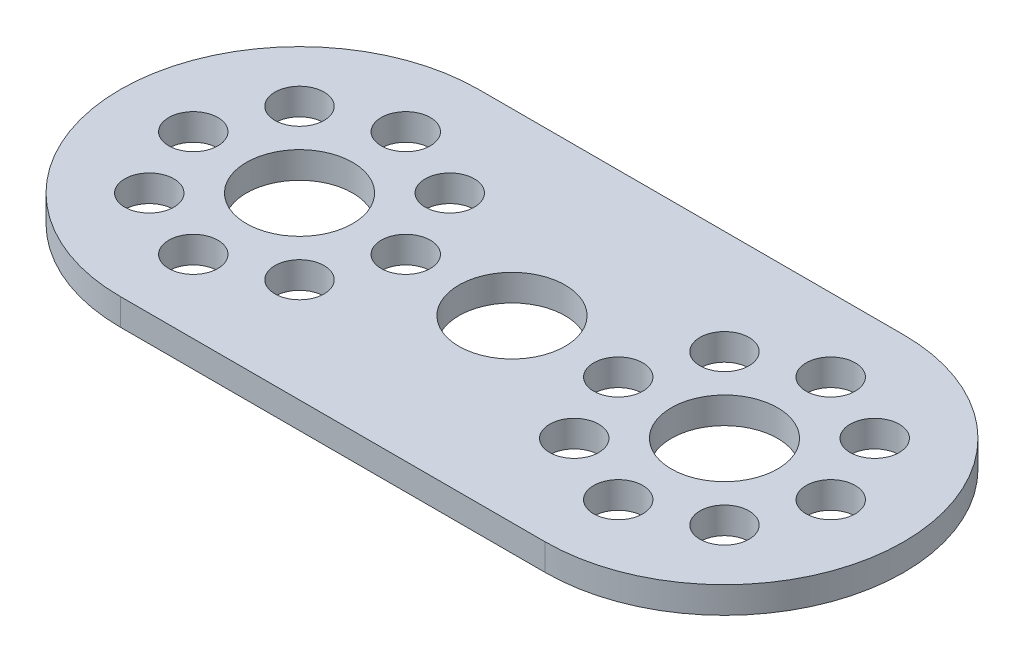
ISO-10303-21;
HEADER;
FILE_DESCRIPTION(('STEP AP214'),'2;1');
FILE_NAME('part.step','',(''),(''),'','','');
FILE_SCHEMA(('AUTOMOTIVE_DESIGN { 1 0 10303 214 1 1 1 1 }'));
ENDSEC;
DATA;
#1=APPLICATION_CONTEXT('core data for automotive mechanical design processes');
#2=APPLICATION_PROTOCOL_DEFINITION('international standard','automotive_design',2000,#1);
#3=PRODUCT_CONTEXT('',#1,'mechanical');
#4=PRODUCT('Part','Part','',(#3));
#5=PRODUCT_RELATED_PRODUCT_CATEGORY('part','',(#4));
#6=PRODUCT_DEFINITION_FORMATION('','',#4);
#7=PRODUCT_DEFINITION_CONTEXT('part definition',#1,'design');
#8=PRODUCT_DEFINITION('design','',#6,#7);
#9=PRODUCT_DEFINITION_SHAPE('','',#8);
#10=(LENGTH_UNIT() NAMED_UNIT(*) SI_UNIT(.MILLI.,.METRE.));
#11=(NAMED_UNIT(*) PLANE_ANGLE_UNIT() SI_UNIT($,.RADIAN.));
#12=(NAMED_UNIT(*) SI_UNIT($,.STERADIAN.) SOLID_ANGLE_UNIT());
#13=UNCERTAINTY_MEASURE_WITH_UNIT(LENGTH_MEASURE(1.E-05),#10,'distance_accuracy_value','');
#14=(GEOMETRIC_REPRESENTATION_CONTEXT(3) GLOBAL_UNCERTAINTY_ASSIGNED_CONTEXT((#13)) GLOBAL_UNIT_ASSIGNED_CONTEXT((#10,
#11,#12)) REPRESENTATION_CONTEXT('',''));
#15=CARTESIAN_POINT('',(0.,0.,0.));
#16=DIRECTION('',(0.,0.,1.));
#17=DIRECTION('',(1.,0.,0.));
#18=AXIS2_PLACEMENT_3D('',#15,#16,#17);
#19=CARTESIAN_POINT('',(-16.,2.,0.));
#20=DIRECTION('',(0.,1.,0.));
#21=DIRECTION('',(0.,0.,1.));
#22=AXIS2_PLACEMENT_3D('',#19,#20,#21);
#23=PLANE('',#22);
#24=CARTESIAN_POINT('',(-8.,2.,0.));
#25=DIRECTION('',(0.,1.,0.));
#26=DIRECTION('',(0.,0.,-1.));
#27=AXIS2_PLACEMENT_3D('',#24,#25,#26);
#28=CIRCLE('',#27,1.85);
#29=CARTESIAN_POINT('',(-8.,2.,-1.85));
#30=VERTEX_POINT('',#29);
#31=EDGE_CURVE('E214',#30,#30,#28,.T.);
#32=ORIENTED_EDGE('',*,*,#31,.F.);
#33=EDGE_LOOP('',(#32));
#34=FACE_BOUND('',#33,.T.);
#35=CARTESIAN_POINT('',(-16.,2.,-8.));
#36=DIRECTION('',(0.,1.,0.));
#37=DIRECTION('',(0.,0.,-1.));
#38=AXIS2_PLACEMENT_3D('',#35,#36,#37);
#39=CIRCLE('',#38,1.85);
#40=CARTESIAN_POINT('',(-16.,2.,-9.85));
#41=VERTEX_POINT('',#40);
#42=EDGE_CURVE('E202',#41,#41,#39,.T.);
#43=ORIENTED_EDGE('',*,*,#42,.F.);
#44=EDGE_LOOP('',(#43));
#45=FACE_BOUND('',#44,.T.);
#46=CARTESIAN_POINT('',(-24.,2.,0.));
#47=DIRECTION('',(0.,1.,0.));
#48=DIRECTION('',(0.,0.,-1.));
#49=AXIS2_PLACEMENT_3D('',#46,#47,#48);
#50=CIRCLE('',#49,1.85);
#51=CARTESIAN_POINT('',(-24.,2.,-1.85000000000001));
#52=VERTEX_POINT('',#51);
#53=EDGE_CURVE('E190',#52,#52,#50,.T.);
#54=ORIENTED_EDGE('',*,*,#53,.F.);
#55=EDGE_LOOP('',(#54));
#56=FACE_BOUND('',#55,.T.);
#57=CARTESIAN_POINT('',(-16.,2.,8.));
#58=DIRECTION('',(0.,1.,0.));
#59=DIRECTION('',(0.,0.,-1.));
#60=AXIS2_PLACEMENT_3D('',#57,#58,#59);
#61=CIRCLE('',#60,1.85);
#62=CARTESIAN_POINT('',(-16.,2.,6.15));
#63=VERTEX_POINT('',#62);
#64=EDGE_CURVE('E178',#63,#63,#61,.T.);
#65=ORIENTED_EDGE('',*,*,#64,.F.);
#66=EDGE_LOOP('',(#65));
#67=FACE_BOUND('',#66,.T.);
#68=CARTESIAN_POINT('',(10.3431457505076,2.,5.65685424949238));
#69=DIRECTION('',(0.,1.,0.));
#70=DIRECTION('',(0.,0.,1.));
#71=AXIS2_PLACEMENT_3D('',#68,#69,#70);
#72=CIRCLE('',#71,1.85);
#73=CARTESIAN_POINT('',(10.3431457505076,2.,7.50685424949238));
#74=VERTEX_POINT('',#73);
#75=EDGE_CURVE('E166',#74,#74,#72,.T.);
#76=ORIENTED_EDGE('',*,*,#75,.F.);
#77=EDGE_LOOP('',(#76));
#78=FACE_BOUND('',#77,.T.);
#79=CARTESIAN_POINT('',(21.6568542494924,2.,5.65685424949237));
#80=DIRECTION('',(0.,1.,0.));
#81=DIRECTION('',(0.,0.,1.));
#82=AXIS2_PLACEMENT_3D('',#79,#80,#81);
#83=CIRCLE('',#82,1.85);
#84=CARTESIAN_POINT('',(21.6568542494924,2.,7.50685424949237));
#85=VERTEX_POINT('',#84);
#86=EDGE_CURVE('E154',#85,#85,#83,.T.);
#87=ORIENTED_EDGE('',*,*,#86,.F.);
#88=EDGE_LOOP('',(#87));
#89=FACE_BOUND('',#88,.T.);
#90=CARTESIAN_POINT('',(21.6568542494924,2.,-5.65685424949239));
#91=DIRECTION('',(0.,1.,0.));
#92=DIRECTION('',(0.,0.,1.));
#93=AXIS2_PLACEMENT_3D('',#90,#91,#92);
#94=CIRCLE('',#93,1.85);
#95=CARTESIAN_POINT('',(21.6568542494924,2.,-3.80685424949238));
#96=VERTEX_POINT('',#95);
#97=EDGE_CURVE('E142',#96,#96,#94,.T.);
#98=ORIENTED_EDGE('',*,*,#97,.F.);
#99=EDGE_LOOP('',(#98));
#100=FACE_BOUND('',#99,.T.);
#101=CARTESIAN_POINT('',(10.3431457505076,2.,-5.65685424949238));
#102=DIRECTION('',(0.,1.,0.));
#103=DIRECTION('',(0.,0.,1.));
#104=AXIS2_PLACEMENT_3D('',#101,#102,#103);
#105=CIRCLE('',#104,1.85);
#106=CARTESIAN_POINT('',(10.3431457505076,2.,-3.80685424949238));
#107=VERTEX_POINT('',#106);
#108=EDGE_CURVE('E130',#107,#107,#105,.T.);
#109=ORIENTED_EDGE('',*,*,#108,.F.);
#110=EDGE_LOOP('',(#109));
#111=FACE_BOUND('',#110,.T.);
#112=CARTESIAN_POINT('',(16.,2.,0.));
#113=DIRECTION('',(0.,1.,0.));
#114=DIRECTION('',(0.,0.,1.));
#115=AXIS2_PLACEMENT_3D('',#112,#113,#114);
#116=CIRCLE('',#115,4.);
#117=CARTESIAN_POINT('',(16.,2.,4.));
#118=VERTEX_POINT('',#117);
#119=EDGE_CURVE('E118',#118,#118,#116,.T.);
#120=ORIENTED_EDGE('',*,*,#119,.F.);
#121=EDGE_LOOP('',(#120));
#122=FACE_BOUND('',#121,.T.);
#123=CARTESIAN_POINT('',(-16.,2.,0.));
#124=DIRECTION('',(0.,1.,0.));
#125=DIRECTION('',(0.,0.,1.));
#126=AXIS2_PLACEMENT_3D('',#123,#124,#125);
#127=CIRCLE('',#126,13.5);
#128=CARTESIAN_POINT('',(-16.,2.,-13.5));
#129=VERTEX_POINT('',#128);
#130=CARTESIAN_POINT('',(-16.,2.,13.5));
#131=VERTEX_POINT('',#130);
#132=EDGE_CURVE('E88',#129,#131,#127,.T.);
#133=ORIENTED_EDGE('',*,*,#132,.T.);
#134=DIRECTION('',(1.,0.,0.));
#135=VECTOR('',#134,1.);
#136=CARTESIAN_POINT('',(-16.,2.,13.5));
#137=LINE('',#136,#135);
#138=CARTESIAN_POINT('',(16.,2.,13.5));
#139=VERTEX_POINT('',#138);
#140=EDGE_CURVE('E83',#131,#139,#137,.T.);
#141=ORIENTED_EDGE('',*,*,#140,.T.);
#142=CARTESIAN_POINT('',(16.,2.,0.));
#143=DIRECTION('',(0.,1.,0.));
#144=DIRECTION('',(0.,0.,-1.));
#145=AXIS2_PLACEMENT_3D('',#142,#143,#144);
#146=CIRCLE('',#145,13.5);
#147=CARTESIAN_POINT('',(16.,2.,-13.5));
#148=VERTEX_POINT('',#147);
#149=EDGE_CURVE('E86',#139,#148,#146,.T.);
#150=ORIENTED_EDGE('',*,*,#149,.T.);
#151=DIRECTION('',(-1.,0.,0.));
#152=VECTOR('',#151,1.);
#153=CARTESIAN_POINT('',(-16.,2.,-13.5));
#154=LINE('',#153,#152);
#155=EDGE_CURVE('E53',#148,#129,#154,.T.);
#156=ORIENTED_EDGE('',*,*,#155,.T.);
#157=EDGE_LOOP('',(#133,#141,#150,#156));
#158=FACE_BOUND('',#157,.T.);
#159=CARTESIAN_POINT('',(0.,2.,0.));
#160=DIRECTION('',(0.,1.,0.));
#161=DIRECTION('',(0.,0.,1.));
#162=AXIS2_PLACEMENT_3D('',#159,#160,#161);
#163=CIRCLE('',#162,4.);
#164=CARTESIAN_POINT('',(0.,2.,4.));
#165=VERTEX_POINT('',#164);
#166=EDGE_CURVE('E103',#165,#165,#163,.T.);
#167=ORIENTED_EDGE('',*,*,#166,.F.);
#168=EDGE_LOOP('',(#167));
#169=FACE_BOUND('',#168,.T.);
#170=CARTESIAN_POINT('',(8.,2.,0.));
#171=DIRECTION('',(0.,1.,0.));
#172=DIRECTION('',(0.,0.,1.));
#173=AXIS2_PLACEMENT_3D('',#170,#171,#172);
#174=CIRCLE('',#173,1.85);
#175=CARTESIAN_POINT('',(8.,2.,1.85));
#176=VERTEX_POINT('',#175);
#177=EDGE_CURVE('E124',#176,#176,#174,.T.);
#178=ORIENTED_EDGE('',*,*,#177,.F.);
#179=EDGE_LOOP('',(#178));
#180=FACE_BOUND('',#179,.T.);
#181=CARTESIAN_POINT('',(16.,2.,-8.));
#182=DIRECTION('',(0.,1.,0.));
#183=DIRECTION('',(0.,0.,1.));
#184=AXIS2_PLACEMENT_3D('',#181,#182,#183);
#185=CIRCLE('',#184,1.85);
#186=CARTESIAN_POINT('',(16.,2.,-6.15));
#187=VERTEX_POINT('',#186);
#188=EDGE_CURVE('E136',#187,#187,#185,.T.);
#189=ORIENTED_EDGE('',*,*,#188,.F.);
#190=EDGE_LOOP('',(#189));
#191=FACE_BOUND('',#190,.T.);
#192=CARTESIAN_POINT('',(24.,2.,0.));
#193=DIRECTION('',(0.,1.,0.));
#194=DIRECTION('',(0.,0.,1.));
#195=AXIS2_PLACEMENT_3D('',#192,#193,#194);
#196=CIRCLE('',#195,1.85);
#197=CARTESIAN_POINT('',(24.,2.,1.85));
#198=VERTEX_POINT('',#197);
#199=EDGE_CURVE('E148',#198,#198,#196,.T.);
#200=ORIENTED_EDGE('',*,*,#199,.F.);
#201=EDGE_LOOP('',(#200));
#202=FACE_BOUND('',#201,.T.);
#203=CARTESIAN_POINT('',(16.,2.,8.));
#204=DIRECTION('',(0.,1.,0.));
#205=DIRECTION('',(0.,0.,1.));
#206=AXIS2_PLACEMENT_3D('',#203,#204,#205);
#207=CIRCLE('',#206,1.85);
#208=CARTESIAN_POINT('',(16.,2.,9.84999999999999));
#209=VERTEX_POINT('',#208);
#210=EDGE_CURVE('E160',#209,#209,#207,.T.);
#211=ORIENTED_EDGE('',*,*,#210,.F.);
#212=EDGE_LOOP('',(#211));
#213=FACE_BOUND('',#212,.T.);
#214=CARTESIAN_POINT('',(-10.3431457505076,2.,5.65685424949238));
#215=DIRECTION('',(0.,1.,0.));
#216=DIRECTION('',(0.,0.,-1.));
#217=AXIS2_PLACEMENT_3D('',#214,#215,#216);
#218=CIRCLE('',#217,1.85);
#219=CARTESIAN_POINT('',(-10.3431457505076,2.,3.80685424949238));
#220=VERTEX_POINT('',#219);
#221=EDGE_CURVE('E172',#220,#220,#218,.T.);
#222=ORIENTED_EDGE('',*,*,#221,.F.);
#223=EDGE_LOOP('',(#222));
#224=FACE_BOUND('',#223,.T.);
#225=CARTESIAN_POINT('',(-21.6568542494924,2.,5.65685424949237));
#226=DIRECTION('',(0.,1.,0.));
#227=DIRECTION('',(0.,0.,-1.));
#228=AXIS2_PLACEMENT_3D('',#225,#226,#227);
#229=CIRCLE('',#228,1.85);
#230=CARTESIAN_POINT('',(-21.6568542494924,2.,3.80685424949238));
#231=VERTEX_POINT('',#230);
#232=EDGE_CURVE('E184',#231,#231,#229,.T.);
#233=ORIENTED_EDGE('',*,*,#232,.F.);
#234=EDGE_LOOP('',(#233));
#235=FACE_BOUND('',#234,.T.);
#236=CARTESIAN_POINT('',(-21.6568542494924,2.,-5.65685424949239));
#237=DIRECTION('',(0.,1.,0.));
#238=DIRECTION('',(0.,0.,-1.));
#239=AXIS2_PLACEMENT_3D('',#236,#237,#238);
#240=CIRCLE('',#239,1.85);
#241=CARTESIAN_POINT('',(-21.6568542494924,2.,-7.50685424949239));
#242=VERTEX_POINT('',#241);
#243=EDGE_CURVE('E196',#242,#242,#240,.T.);
#244=ORIENTED_EDGE('',*,*,#243,.F.);
#245=EDGE_LOOP('',(#244));
#246=FACE_BOUND('',#245,.T.);
#247=CARTESIAN_POINT('',(-10.3431457505076,2.,-5.65685424949238));
#248=DIRECTION('',(0.,1.,0.));
#249=DIRECTION('',(0.,0.,-1.));
#250=AXIS2_PLACEMENT_3D('',#247,#248,#249);
#251=CIRCLE('',#250,1.85);
#252=CARTESIAN_POINT('',(-10.3431457505076,2.,-7.50685424949238));
#253=VERTEX_POINT('',#252);
#254=EDGE_CURVE('E208',#253,#253,#251,.T.);
#255=ORIENTED_EDGE('',*,*,#254,.F.);
#256=EDGE_LOOP('',(#255));
#257=FACE_BOUND('',#256,.T.);
#258=CARTESIAN_POINT('',(-16.,2.,0.));
#259=DIRECTION('',(0.,1.,0.));
#260=DIRECTION('',(0.,0.,-1.));
#261=AXIS2_PLACEMENT_3D('',#258,#259,#260);
#262=CIRCLE('',#261,4.);
#263=CARTESIAN_POINT('',(-16.,2.,-4.));
#264=VERTEX_POINT('',#263);
#265=EDGE_CURVE('E220',#264,#264,#262,.T.);
#266=ORIENTED_EDGE('',*,*,#265,.F.);
#267=EDGE_LOOP('',(#266));
#268=FACE_BOUND('',#267,.T.);
#269=ADVANCED_FACE('F36',(#34,#45,#56,#67,#78,#89,#100,#111,#122,#158,#169,#180,#191,#202,#213,
#224,#235,#246,#257,#268),#23,.T.);
#270=CARTESIAN_POINT('',(-16.,0.,0.));
#271=DIRECTION('',(0.,1.,0.));
#272=DIRECTION('',(0.,0.,1.));
#273=AXIS2_PLACEMENT_3D('',#270,#271,#272);
#274=PLANE('',#273);
#275=CARTESIAN_POINT('',(-16.,0.,0.));
#276=DIRECTION('',(0.,1.,0.));
#277=DIRECTION('',(0.,0.,1.));
#278=AXIS2_PLACEMENT_3D('',#275,#276,#277);
#279=CIRCLE('',#278,13.5);
#280=CARTESIAN_POINT('',(-16.,0.,-13.5));
#281=VERTEX_POINT('',#280);
#282=CARTESIAN_POINT('',(-16.,0.,13.5));
#283=VERTEX_POINT('',#282);
#284=EDGE_CURVE('E100',#281,#283,#279,.T.);
#285=ORIENTED_EDGE('',*,*,#284,.F.);
#286=DIRECTION('',(-1.,0.,0.));
#287=VECTOR('',#286,1.);
#288=CARTESIAN_POINT('',(-16.,0.,-13.5));
#289=LINE('',#288,#287);
#290=CARTESIAN_POINT('',(16.,0.,-13.5));
#291=VERTEX_POINT('',#290);
#292=EDGE_CURVE('E76',#291,#281,#289,.T.);
#293=ORIENTED_EDGE('',*,*,#292,.F.);
#294=CARTESIAN_POINT('',(16.,0.,0.));
#295=DIRECTION('',(0.,1.,0.));
#296=DIRECTION('',(0.,0.,-1.));
#297=AXIS2_PLACEMENT_3D('',#294,#295,#296);
#298=CIRCLE('',#297,13.5);
#299=CARTESIAN_POINT('',(16.,0.,13.5));
#300=VERTEX_POINT('',#299);
#301=EDGE_CURVE('E70',#300,#291,#298,.T.);
#302=ORIENTED_EDGE('',*,*,#301,.F.);
#303=DIRECTION('',(1.,0.,0.));
#304=VECTOR('',#303,1.);
#305=CARTESIAN_POINT('',(-16.,0.,13.5));
#306=LINE('',#305,#304);
#307=EDGE_CURVE('E92',#283,#300,#306,.T.);
#308=ORIENTED_EDGE('',*,*,#307,.F.);
#309=EDGE_LOOP('',(#285,#293,#302,#308));
#310=FACE_BOUND('',#309,.T.);
#311=CARTESIAN_POINT('',(0.,0.,0.));
#312=DIRECTION('',(0.,1.,0.));
#313=DIRECTION('',(0.,0.,1.));
#314=AXIS2_PLACEMENT_3D('',#311,#312,#313);
#315=CIRCLE('',#314,4.);
#316=CARTESIAN_POINT('',(0.,0.,4.));
#317=VERTEX_POINT('',#316);
#318=EDGE_CURVE('E115',#317,#317,#315,.T.);
#319=ORIENTED_EDGE('',*,*,#318,.T.);
#320=EDGE_LOOP('',(#319));
#321=FACE_BOUND('',#320,.T.);
#322=CARTESIAN_POINT('',(16.,0.,0.));
#323=DIRECTION('',(0.,1.,0.));
#324=DIRECTION('',(0.,0.,1.));
#325=AXIS2_PLACEMENT_3D('',#322,#323,#324);
#326=CIRCLE('',#325,4.);
#327=CARTESIAN_POINT('',(16.,0.,4.));
#328=VERTEX_POINT('',#327);
#329=EDGE_CURVE('E121',#328,#328,#326,.T.);
#330=ORIENTED_EDGE('',*,*,#329,.T.);
#331=EDGE_LOOP('',(#330));
#332=FACE_BOUND('',#331,.T.);
#333=CARTESIAN_POINT('',(8.,0.,0.));
#334=DIRECTION('',(0.,1.,0.));
#335=DIRECTION('',(0.,0.,1.));
#336=AXIS2_PLACEMENT_3D('',#333,#334,#335);
#337=CIRCLE('',#336,1.85);
#338=CARTESIAN_POINT('',(8.,0.,1.85));
#339=VERTEX_POINT('',#338);
#340=EDGE_CURVE('E127',#339,#339,#337,.T.);
#341=ORIENTED_EDGE('',*,*,#340,.T.);
#342=EDGE_LOOP('',(#341));
#343=FACE_BOUND('',#342,.T.);
#344=CARTESIAN_POINT('',(10.3431457505076,0.,-5.65685424949238));
#345=DIRECTION('',(0.,1.,0.));
#346=DIRECTION('',(0.,0.,1.));
#347=AXIS2_PLACEMENT_3D('',#344,#345,#346);
#348=CIRCLE('',#347,1.85);
#349=CARTESIAN_POINT('',(10.3431457505076,0.,-3.80685424949238));
#350=VERTEX_POINT('',#349);
#351=EDGE_CURVE('E133',#350,#350,#348,.T.);
#352=ORIENTED_EDGE('',*,*,#351,.T.);
#353=EDGE_LOOP('',(#352));
#354=FACE_BOUND('',#353,.T.);
#355=CARTESIAN_POINT('',(16.,0.,-8.));
#356=DIRECTION('',(0.,1.,0.));
#357=DIRECTION('',(0.,0.,1.));
#358=AXIS2_PLACEMENT_3D('',#355,#356,#357);
#359=CIRCLE('',#358,1.85);
#360=CARTESIAN_POINT('',(16.,0.,-6.15));
#361=VERTEX_POINT('',#360);
#362=EDGE_CURVE('E139',#361,#361,#359,.T.);
#363=ORIENTED_EDGE('',*,*,#362,.T.);
#364=EDGE_LOOP('',(#363));
#365=FACE_BOUND('',#364,.T.);
#366=CARTESIAN_POINT('',(21.6568542494924,0.,-5.65685424949239));
#367=DIRECTION('',(0.,1.,0.));
#368=DIRECTION('',(0.,0.,1.));
#369=AXIS2_PLACEMENT_3D('',#366,#367,#368);
#370=CIRCLE('',#369,1.85);
#371=CARTESIAN_POINT('',(21.6568542494924,0.,-3.80685424949238));
#372=VERTEX_POINT('',#371);
#373=EDGE_CURVE('E145',#372,#372,#370,.T.);
#374=ORIENTED_EDGE('',*,*,#373,.T.);
#375=EDGE_LOOP('',(#374));
#376=FACE_BOUND('',#375,.T.);
#377=CARTESIAN_POINT('',(24.,0.,0.));
#378=DIRECTION('',(0.,1.,0.));
#379=DIRECTION('',(0.,0.,1.));
#380=AXIS2_PLACEMENT_3D('',#377,#378,#379);
#381=CIRCLE('',#380,1.85);
#382=CARTESIAN_POINT('',(24.,0.,1.85));
#383=VERTEX_POINT('',#382);
#384=EDGE_CURVE('E151',#383,#383,#381,.T.);
#385=ORIENTED_EDGE('',*,*,#384,.T.);
#386=EDGE_LOOP('',(#385));
#387=FACE_BOUND('',#386,.T.);
#388=CARTESIAN_POINT('',(21.6568542494924,0.,5.65685424949237));
#389=DIRECTION('',(0.,1.,0.));
#390=DIRECTION('',(0.,0.,1.));
#391=AXIS2_PLACEMENT_3D('',#388,#389,#390);
#392=CIRCLE('',#391,1.85);
#393=CARTESIAN_POINT('',(21.6568542494924,0.,7.50685424949237));
#394=VERTEX_POINT('',#393);
#395=EDGE_CURVE('E157',#394,#394,#392,.T.);
#396=ORIENTED_EDGE('',*,*,#395,.T.);
#397=EDGE_LOOP('',(#396));
#398=FACE_BOUND('',#397,.T.);
#399=CARTESIAN_POINT('',(16.,0.,8.));
#400=DIRECTION('',(0.,1.,0.));
#401=DIRECTION('',(0.,0.,1.));
#402=AXIS2_PLACEMENT_3D('',#399,#400,#401);
#403=CIRCLE('',#402,1.85);
#404=CARTESIAN_POINT('',(16.,0.,9.84999999999999));
#405=VERTEX_POINT('',#404);
#406=EDGE_CURVE('E163',#405,#405,#403,.T.);
#407=ORIENTED_EDGE('',*,*,#406,.T.);
#408=EDGE_LOOP('',(#407));
#409=FACE_BOUND('',#408,.T.);
#410=CARTESIAN_POINT('',(10.3431457505076,0.,5.65685424949238));
#411=DIRECTION('',(0.,1.,0.));
#412=DIRECTION('',(0.,0.,1.));
#413=AXIS2_PLACEMENT_3D('',#410,#411,#412);
#414=CIRCLE('',#413,1.85);
#415=CARTESIAN_POINT('',(10.3431457505076,0.,7.50685424949238));
#416=VERTEX_POINT('',#415);
#417=EDGE_CURVE('E169',#416,#416,#414,.T.);
#418=ORIENTED_EDGE('',*,*,#417,.T.);
#419=EDGE_LOOP('',(#418));
#420=FACE_BOUND('',#419,.T.);
#421=CARTESIAN_POINT('',(-10.3431457505076,0.,5.65685424949238));
#422=DIRECTION('',(0.,1.,0.));
#423=DIRECTION('',(0.,0.,-1.));
#424=AXIS2_PLACEMENT_3D('',#421,#422,#423);
#425=CIRCLE('',#424,1.85);
#426=CARTESIAN_POINT('',(-10.3431457505076,0.,3.80685424949238));
#427=VERTEX_POINT('',#426);
#428=EDGE_CURVE('E175',#427,#427,#425,.T.);
#429=ORIENTED_EDGE('',*,*,#428,.T.);
#430=EDGE_LOOP('',(#429));
#431=FACE_BOUND('',#430,.T.);
#432=CARTESIAN_POINT('',(-16.,0.,8.));
#433=DIRECTION('',(0.,1.,0.));
#434=DIRECTION('',(0.,0.,-1.));
#435=AXIS2_PLACEMENT_3D('',#432,#433,#434);
#436=CIRCLE('',#435,1.85);
#437=CARTESIAN_POINT('',(-16.,0.,6.15));
#438=VERTEX_POINT('',#437);
#439=EDGE_CURVE('E181',#438,#438,#436,.T.);
#440=ORIENTED_EDGE('',*,*,#439,.T.);
#441=EDGE_LOOP('',(#440));
#442=FACE_BOUND('',#441,.T.);
#443=CARTESIAN_POINT('',(-21.6568542494924,0.,5.65685424949237));
#444=DIRECTION('',(0.,1.,0.));
#445=DIRECTION('',(0.,0.,-1.));
#446=AXIS2_PLACEMENT_3D('',#443,#444,#445);
#447=CIRCLE('',#446,1.85);
#448=CARTESIAN_POINT('',(-21.6568542494924,0.,3.80685424949238));
#449=VERTEX_POINT('',#448);
#450=EDGE_CURVE('E187',#449,#449,#447,.T.);
#451=ORIENTED_EDGE('',*,*,#450,.T.);
#452=EDGE_LOOP('',(#451));
#453=FACE_BOUND('',#452,.T.);
#454=CARTESIAN_POINT('',(-24.,0.,0.));
#455=DIRECTION('',(0.,1.,0.));
#456=DIRECTION('',(0.,0.,-1.));
#457=AXIS2_PLACEMENT_3D('',#454,#455,#456);
#458=CIRCLE('',#457,1.85);
#459=CARTESIAN_POINT('',(-24.,0.,-1.85000000000001));
#460=VERTEX_POINT('',#459);
#461=EDGE_CURVE('E193',#460,#460,#458,.T.);
#462=ORIENTED_EDGE('',*,*,#461,.T.);
#463=EDGE_LOOP('',(#462));
#464=FACE_BOUND('',#463,.T.);
#465=CARTESIAN_POINT('',(-21.6568542494924,0.,-5.65685424949239));
#466=DIRECTION('',(0.,1.,0.));
#467=DIRECTION('',(0.,0.,-1.));
#468=AXIS2_PLACEMENT_3D('',#465,#466,#467);
#469=CIRCLE('',#468,1.85);
#470=CARTESIAN_POINT('',(-21.6568542494924,0.,-7.50685424949239));
#471=VERTEX_POINT('',#470);
#472=EDGE_CURVE('E199',#471,#471,#469,.T.);
#473=ORIENTED_EDGE('',*,*,#472,.T.);
#474=EDGE_LOOP('',(#473));
#475=FACE_BOUND('',#474,.T.);
#476=CARTESIAN_POINT('',(-16.,0.,-8.));
#477=DIRECTION('',(0.,1.,0.));
#478=DIRECTION('',(0.,0.,-1.));
#479=AXIS2_PLACEMENT_3D('',#476,#477,#478);
#480=CIRCLE('',#479,1.85);
#481=CARTESIAN_POINT('',(-16.,0.,-9.85));
#482=VERTEX_POINT('',#481);
#483=EDGE_CURVE('E205',#482,#482,#480,.T.);
#484=ORIENTED_EDGE('',*,*,#483,.T.);
#485=EDGE_LOOP('',(#484));
#486=FACE_BOUND('',#485,.T.);
#487=CARTESIAN_POINT('',(-10.3431457505076,0.,-5.65685424949238));
#488=DIRECTION('',(0.,1.,0.));
#489=DIRECTION('',(0.,0.,-1.));
#490=AXIS2_PLACEMENT_3D('',#487,#488,#489);
#491=CIRCLE('',#490,1.85);
#492=CARTESIAN_POINT('',(-10.3431457505076,0.,-7.50685424949238));
#493=VERTEX_POINT('',#492);
#494=EDGE_CURVE('E211',#493,#493,#491,.T.);
#495=ORIENTED_EDGE('',*,*,#494,.T.);
#496=EDGE_LOOP('',(#495));
#497=FACE_BOUND('',#496,.T.);
#498=CARTESIAN_POINT('',(-8.,0.,0.));
#499=DIRECTION('',(0.,1.,0.));
#500=DIRECTION('',(0.,0.,-1.));
#501=AXIS2_PLACEMENT_3D('',#498,#499,#500);
#502=CIRCLE('',#501,1.85);
#503=CARTESIAN_POINT('',(-8.,0.,-1.85));
#504=VERTEX_POINT('',#503);
#505=EDGE_CURVE('E217',#504,#504,#502,.T.);
#506=ORIENTED_EDGE('',*,*,#505,.T.);
#507=EDGE_LOOP('',(#506));
#508=FACE_BOUND('',#507,.T.);
#509=CARTESIAN_POINT('',(-16.,0.,0.));
#510=DIRECTION('',(0.,1.,0.));
#511=DIRECTION('',(0.,0.,-1.));
#512=AXIS2_PLACEMENT_3D('',#509,#510,#511);
#513=CIRCLE('',#512,4.);
#514=CARTESIAN_POINT('',(-16.,0.,-4.));
#515=VERTEX_POINT('',#514);
#516=EDGE_CURVE('E223',#515,#515,#513,.T.);
#517=ORIENTED_EDGE('',*,*,#516,.T.);
#518=EDGE_LOOP('',(#517));
#519=FACE_BOUND('',#518,.T.);
#520=ADVANCED_FACE('F111',(#310,#321,#332,#343,#354,#365,#376,#387,#398,#409,#420,#431,#442,
#453,#464,#475,#486,#497,#508,#519),#274,.F.);
#521=CARTESIAN_POINT('',(-16.,2.,0.));
#522=DIRECTION('',(0.,-1.,0.));
#523=DIRECTION('',(0.,0.,-1.));
#524=AXIS2_PLACEMENT_3D('',#521,#522,#523);
#525=CYLINDRICAL_SURFACE('',#524,13.5);
#526=ORIENTED_EDGE('',*,*,#284,.T.);
#527=DIRECTION('',(0.,-1.,0.));
#528=VECTOR('',#527,1.);
#529=CARTESIAN_POINT('',(-16.,2.,13.5));
#530=LINE('',#529,#528);
#531=EDGE_CURVE('E11',#131,#283,#530,.T.);
#532=ORIENTED_EDGE('',*,*,#531,.F.);
#533=ORIENTED_EDGE('',*,*,#132,.F.);
#534=DIRECTION('',(0.,-1.,0.));
#535=VECTOR('',#534,1.);
#536=CARTESIAN_POINT('',(-16.,2.,-13.5));
#537=LINE('',#536,#535);
#538=EDGE_CURVE('E96',#129,#281,#537,.T.);
#539=ORIENTED_EDGE('',*,*,#538,.T.);
#540=EDGE_LOOP('',(#526,#532,#533,#539));
#541=FACE_BOUND('',#540,.T.);
#542=ADVANCED_FACE('F38',(#541),#525,.T.);
#543=CARTESIAN_POINT('',(-16.,2.,13.5));
#544=DIRECTION('',(0.,0.,-1.));
#545=DIRECTION('',(-1.,0.,0.));
#546=AXIS2_PLACEMENT_3D('',#543,#544,#545);
#547=PLANE('',#546);
#548=ORIENTED_EDGE('',*,*,#307,.T.);
#549=DIRECTION('',(0.,-1.,0.));
#550=VECTOR('',#549,1.);
#551=CARTESIAN_POINT('',(16.,2.,13.5));
#552=LINE('',#551,#550);
#553=EDGE_CURVE('E45',#139,#300,#552,.T.);
#554=ORIENTED_EDGE('',*,*,#553,.F.);
#555=ORIENTED_EDGE('',*,*,#140,.F.);
#556=ORIENTED_EDGE('',*,*,#531,.T.);
#557=EDGE_LOOP('',(#548,#554,#555,#556));
#558=FACE_BOUND('',#557,.T.);
#559=ADVANCED_FACE('F91',(#558),#547,.F.);
#560=CARTESIAN_POINT('',(16.,2.,0.));
#561=DIRECTION('',(0.,-1.,0.));
#562=DIRECTION('',(0.,0.,-1.));
#563=AXIS2_PLACEMENT_3D('',#560,#561,#562);
#564=CYLINDRICAL_SURFACE('',#563,13.5);
#565=ORIENTED_EDGE('',*,*,#301,.T.);
#566=DIRECTION('',(0.,-1.,0.));
#567=VECTOR('',#566,1.);
#568=CARTESIAN_POINT('',(16.,2.,-13.5));
#569=LINE('',#568,#567);
#570=EDGE_CURVE('E93',#148,#291,#569,.T.);
#571=ORIENTED_EDGE('',*,*,#570,.F.);
#572=ORIENTED_EDGE('',*,*,#149,.F.);
#573=ORIENTED_EDGE('',*,*,#553,.T.);
#574=EDGE_LOOP('',(#565,#571,#572,#573));
#575=FACE_BOUND('',#574,.T.);
#576=ADVANCED_FACE('F94',(#575),#564,.T.);
#577=CARTESIAN_POINT('',(-16.,2.,-13.5));
#578=DIRECTION('',(0.,0.,1.));
#579=DIRECTION('',(1.,0.,0.));
#580=AXIS2_PLACEMENT_3D('',#577,#578,#579);
#581=PLANE('',#580);
#582=ORIENTED_EDGE('',*,*,#292,.T.);
#583=ORIENTED_EDGE('',*,*,#538,.F.);
#584=ORIENTED_EDGE('',*,*,#155,.F.);
#585=ORIENTED_EDGE('',*,*,#570,.T.);
#586=EDGE_LOOP('',(#582,#583,#584,#585));
#587=FACE_BOUND('',#586,.T.);
#588=ADVANCED_FACE('F108',(#587),#581,.F.);
#589=CARTESIAN_POINT('',(0.,2.,0.));
#590=DIRECTION('',(0.,-1.,0.));
#591=DIRECTION('',(0.,0.,-1.));
#592=AXIS2_PLACEMENT_3D('',#589,#590,#591);
#593=CYLINDRICAL_SURFACE('',#592,4.);
#594=ORIENTED_EDGE('',*,*,#166,.T.);
#595=EDGE_LOOP('',(#594));
#596=FACE_BOUND('',#595,.T.);
#597=ORIENTED_EDGE('',*,*,#318,.F.);
#598=EDGE_LOOP('',(#597));
#599=FACE_BOUND('',#598,.T.);
#600=ADVANCED_FACE('F242',(#596,#599),#593,.F.);
#601=CARTESIAN_POINT('',(16.,2.,0.));
#602=DIRECTION('',(0.,-1.,0.));
#603=DIRECTION('',(0.,0.,-1.));
#604=AXIS2_PLACEMENT_3D('',#601,#602,#603);
#605=CYLINDRICAL_SURFACE('',#604,4.);
#606=ORIENTED_EDGE('',*,*,#119,.T.);
#607=EDGE_LOOP('',(#606));
#608=FACE_BOUND('',#607,.T.);
#609=ORIENTED_EDGE('',*,*,#329,.F.);
#610=EDGE_LOOP('',(#609));
#611=FACE_BOUND('',#610,.T.);
#612=ADVANCED_FACE('F288',(#608,#611),#605,.F.);
#613=CARTESIAN_POINT('',(8.,2.,0.));
#614=DIRECTION('',(0.,-1.,0.));
#615=DIRECTION('',(0.,0.,-1.));
#616=AXIS2_PLACEMENT_3D('',#613,#614,#615);
#617=CYLINDRICAL_SURFACE('',#616,1.85);
#618=ORIENTED_EDGE('',*,*,#177,.T.);
#619=EDGE_LOOP('',(#618));
#620=FACE_BOUND('',#619,.T.);
#621=ORIENTED_EDGE('',*,*,#340,.F.);
#622=EDGE_LOOP('',(#621));
#623=FACE_BOUND('',#622,.T.);
#624=ADVANCED_FACE('F296',(#620,#623),#617,.F.);
#625=CARTESIAN_POINT('',(10.3431457505076,2.,-5.65685424949238));
#626=DIRECTION('',(0.,-1.,0.));
#627=DIRECTION('',(0.,0.,-1.));
#628=AXIS2_PLACEMENT_3D('',#625,#626,#627);
#629=CYLINDRICAL_SURFACE('',#628,1.85);
#630=ORIENTED_EDGE('',*,*,#108,.T.);
#631=EDGE_LOOP('',(#630));
#632=FACE_BOUND('',#631,.T.);
#633=ORIENTED_EDGE('',*,*,#351,.F.);
#634=EDGE_LOOP('',(#633));
#635=FACE_BOUND('',#634,.T.);
#636=ADVANCED_FACE('F304',(#632,#635),#629,.F.);
#637=CARTESIAN_POINT('',(16.,2.,-8.));
#638=DIRECTION('',(0.,-1.,0.));
#639=DIRECTION('',(0.,0.,-1.));
#640=AXIS2_PLACEMENT_3D('',#637,#638,#639);
#641=CYLINDRICAL_SURFACE('',#640,1.85);
#642=ORIENTED_EDGE('',*,*,#188,.T.);
#643=EDGE_LOOP('',(#642));
#644=FACE_BOUND('',#643,.T.);
#645=ORIENTED_EDGE('',*,*,#362,.F.);
#646=EDGE_LOOP('',(#645));
#647=FACE_BOUND('',#646,.T.);
#648=ADVANCED_FACE('F313',(#644,#647),#641,.F.);
#649=CARTESIAN_POINT('',(21.6568542494924,2.,-5.65685424949239));
#650=DIRECTION('',(0.,-1.,0.));
#651=DIRECTION('',(0.,0.,-1.));
#652=AXIS2_PLACEMENT_3D('',#649,#650,#651);
#653=CYLINDRICAL_SURFACE('',#652,1.85);
#654=ORIENTED_EDGE('',*,*,#97,.T.);
#655=EDGE_LOOP('',(#654));
#656=FACE_BOUND('',#655,.T.);
#657=ORIENTED_EDGE('',*,*,#373,.F.);
#658=EDGE_LOOP('',(#657));
#659=FACE_BOUND('',#658,.T.);
#660=ADVANCED_FACE('F322',(#656,#659),#653,.F.);
#661=CARTESIAN_POINT('',(24.,2.,0.));
#662=DIRECTION('',(0.,-1.,0.));
#663=DIRECTION('',(0.,0.,-1.));
#664=AXIS2_PLACEMENT_3D('',#661,#662,#663);
#665=CYLINDRICAL_SURFACE('',#664,1.85);
#666=ORIENTED_EDGE('',*,*,#199,.T.);
#667=EDGE_LOOP('',(#666));
#668=FACE_BOUND('',#667,.T.);
#669=ORIENTED_EDGE('',*,*,#384,.F.);
#670=EDGE_LOOP('',(#669));
#671=FACE_BOUND('',#670,.T.);
#672=ADVANCED_FACE('F331',(#668,#671),#665,.F.);
#673=CARTESIAN_POINT('',(21.6568542494924,2.,5.65685424949237));
#674=DIRECTION('',(0.,-1.,0.));
#675=DIRECTION('',(0.,0.,-1.));
#676=AXIS2_PLACEMENT_3D('',#673,#674,#675);
#677=CYLINDRICAL_SURFACE('',#676,1.85);
#678=ORIENTED_EDGE('',*,*,#86,.T.);
#679=EDGE_LOOP('',(#678));
#680=FACE_BOUND('',#679,.T.);
#681=ORIENTED_EDGE('',*,*,#395,.F.);
#682=EDGE_LOOP('',(#681));
#683=FACE_BOUND('',#682,.T.);
#684=ADVANCED_FACE('F340',(#680,#683),#677,.F.);
#685=CARTESIAN_POINT('',(16.,2.,8.));
#686=DIRECTION('',(0.,-1.,0.));
#687=DIRECTION('',(0.,0.,-1.));
#688=AXIS2_PLACEMENT_3D('',#685,#686,#687);
#689=CYLINDRICAL_SURFACE('',#688,1.85);
#690=ORIENTED_EDGE('',*,*,#210,.T.);
#691=EDGE_LOOP('',(#690));
#692=FACE_BOUND('',#691,.T.);
#693=ORIENTED_EDGE('',*,*,#406,.F.);
#694=EDGE_LOOP('',(#693));
#695=FACE_BOUND('',#694,.T.);
#696=ADVANCED_FACE('F349',(#692,#695),#689,.F.);
#697=CARTESIAN_POINT('',(10.3431457505076,2.,5.65685424949238));
#698=DIRECTION('',(0.,-1.,0.));
#699=DIRECTION('',(0.,0.,-1.));
#700=AXIS2_PLACEMENT_3D('',#697,#698,#699);
#701=CYLINDRICAL_SURFACE('',#700,1.85);
#702=ORIENTED_EDGE('',*,*,#75,.T.);
#703=EDGE_LOOP('',(#702));
#704=FACE_BOUND('',#703,.T.);
#705=ORIENTED_EDGE('',*,*,#417,.F.);
#706=EDGE_LOOP('',(#705));
#707=FACE_BOUND('',#706,.T.);
#708=ADVANCED_FACE('F358',(#704,#707),#701,.F.);
#709=CARTESIAN_POINT('',(-10.3431457505076,2.,5.65685424949238));
#710=DIRECTION('',(0.,-1.,0.));
#711=DIRECTION('',(0.,0.,-1.));
#712=AXIS2_PLACEMENT_3D('',#709,#710,#711);
#713=CYLINDRICAL_SURFACE('',#712,1.85);
#714=ORIENTED_EDGE('',*,*,#221,.T.);
#715=EDGE_LOOP('',(#714));
#716=FACE_BOUND('',#715,.T.);
#717=ORIENTED_EDGE('',*,*,#428,.F.);
#718=EDGE_LOOP('',(#717));
#719=FACE_BOUND('',#718,.T.);
#720=ADVANCED_FACE('F367',(#716,#719),#713,.F.);
#721=CARTESIAN_POINT('',(-16.,2.,8.));
#722=DIRECTION('',(0.,-1.,0.));
#723=DIRECTION('',(0.,0.,-1.));
#724=AXIS2_PLACEMENT_3D('',#721,#722,#723);
#725=CYLINDRICAL_SURFACE('',#724,1.85);
#726=ORIENTED_EDGE('',*,*,#64,.T.);
#727=EDGE_LOOP('',(#726));
#728=FACE_BOUND('',#727,.T.);
#729=ORIENTED_EDGE('',*,*,#439,.F.);
#730=EDGE_LOOP('',(#729));
#731=FACE_BOUND('',#730,.T.);
#732=ADVANCED_FACE('F376',(#728,#731),#725,.F.);
#733=CARTESIAN_POINT('',(-21.6568542494924,2.,5.65685424949237));
#734=DIRECTION('',(0.,-1.,0.));
#735=DIRECTION('',(0.,0.,-1.));
#736=AXIS2_PLACEMENT_3D('',#733,#734,#735);
#737=CYLINDRICAL_SURFACE('',#736,1.85);
#738=ORIENTED_EDGE('',*,*,#232,.T.);
#739=EDGE_LOOP('',(#738));
#740=FACE_BOUND('',#739,.T.);
#741=ORIENTED_EDGE('',*,*,#450,.F.);
#742=EDGE_LOOP('',(#741));
#743=FACE_BOUND('',#742,.T.);
#744=ADVANCED_FACE('F385',(#740,#743),#737,.F.);
#745=CARTESIAN_POINT('',(-24.,2.,0.));
#746=DIRECTION('',(0.,-1.,0.));
#747=DIRECTION('',(0.,0.,-1.));
#748=AXIS2_PLACEMENT_3D('',#745,#746,#747);
#749=CYLINDRICAL_SURFACE('',#748,1.85);
#750=ORIENTED_EDGE('',*,*,#53,.T.);
#751=EDGE_LOOP('',(#750));
#752=FACE_BOUND('',#751,.T.);
#753=ORIENTED_EDGE('',*,*,#461,.F.);
#754=EDGE_LOOP('',(#753));
#755=FACE_BOUND('',#754,.T.);
#756=ADVANCED_FACE('F394',(#752,#755),#749,.F.);
#757=CARTESIAN_POINT('',(-21.6568542494924,2.,-5.65685424949239));
#758=DIRECTION('',(0.,-1.,0.));
#759=DIRECTION('',(0.,0.,-1.));
#760=AXIS2_PLACEMENT_3D('',#757,#758,#759);
#761=CYLINDRICAL_SURFACE('',#760,1.85);
#762=ORIENTED_EDGE('',*,*,#243,.T.);
#763=EDGE_LOOP('',(#762));
#764=FACE_BOUND('',#763,.T.);
#765=ORIENTED_EDGE('',*,*,#472,.F.);
#766=EDGE_LOOP('',(#765));
#767=FACE_BOUND('',#766,.T.);
#768=ADVANCED_FACE('F403',(#764,#767),#761,.F.);
#769=CARTESIAN_POINT('',(-16.,2.,-8.));
#770=DIRECTION('',(0.,-1.,0.));
#771=DIRECTION('',(0.,0.,-1.));
#772=AXIS2_PLACEMENT_3D('',#769,#770,#771);
#773=CYLINDRICAL_SURFACE('',#772,1.85);
#774=ORIENTED_EDGE('',*,*,#42,.T.);
#775=EDGE_LOOP('',(#774));
#776=FACE_BOUND('',#775,.T.);
#777=ORIENTED_EDGE('',*,*,#483,.F.);
#778=EDGE_LOOP('',(#777));
#779=FACE_BOUND('',#778,.T.);
#780=ADVANCED_FACE('F412',(#776,#779),#773,.F.);
#781=CARTESIAN_POINT('',(-10.3431457505076,2.,-5.65685424949238));
#782=DIRECTION('',(0.,-1.,0.));
#783=DIRECTION('',(0.,0.,-1.));
#784=AXIS2_PLACEMENT_3D('',#781,#782,#783);
#785=CYLINDRICAL_SURFACE('',#784,1.85);
#786=ORIENTED_EDGE('',*,*,#254,.T.);
#787=EDGE_LOOP('',(#786));
#788=FACE_BOUND('',#787,.T.);
#789=ORIENTED_EDGE('',*,*,#494,.F.);
#790=EDGE_LOOP('',(#789));
#791=FACE_BOUND('',#790,.T.);
#792=ADVANCED_FACE('F421',(#788,#791),#785,.F.);
#793=CARTESIAN_POINT('',(-8.,2.,0.));
#794=DIRECTION('',(0.,-1.,0.));
#795=DIRECTION('',(0.,0.,-1.));
#796=AXIS2_PLACEMENT_3D('',#793,#794,#795);
#797=CYLINDRICAL_SURFACE('',#796,1.85);
#798=ORIENTED_EDGE('',*,*,#31,.T.);
#799=EDGE_LOOP('',(#798));
#800=FACE_BOUND('',#799,.T.);
#801=ORIENTED_EDGE('',*,*,#505,.F.);
#802=EDGE_LOOP('',(#801));
#803=FACE_BOUND('',#802,.T.);
#804=ADVANCED_FACE('F430',(#800,#803),#797,.F.);
#805=CARTESIAN_POINT('',(-16.,2.,0.));
#806=DIRECTION('',(0.,-1.,0.));
#807=DIRECTION('',(0.,0.,-1.));
#808=AXIS2_PLACEMENT_3D('',#805,#806,#807);
#809=CYLINDRICAL_SURFACE('',#808,4.);
#810=ORIENTED_EDGE('',*,*,#265,.T.);
#811=EDGE_LOOP('',(#810));
#812=FACE_BOUND('',#811,.T.);
#813=ORIENTED_EDGE('',*,*,#516,.F.);
#814=EDGE_LOOP('',(#813));
#815=FACE_BOUND('',#814,.T.);
#816=ADVANCED_FACE('F229',(#812,#815),#809,.F.);
#817=CLOSED_SHELL('',(#269,#520,#542,#559,#576,#588,#600,#612,#624,#636,#648,#660,#672,#684,
#696,#708,#720,#732,#744,#756,#768,#780,#792,#804,#816));
#818=MANIFOLD_SOLID_BREP('B2',#817);
#819=ADVANCED_BREP_SHAPE_REPRESENTATION('',(#18,#818),#14);
#820=SHAPE_DEFINITION_REPRESENTATION(#9,#819);
ENDSEC;
END-ISO-10303-21;
